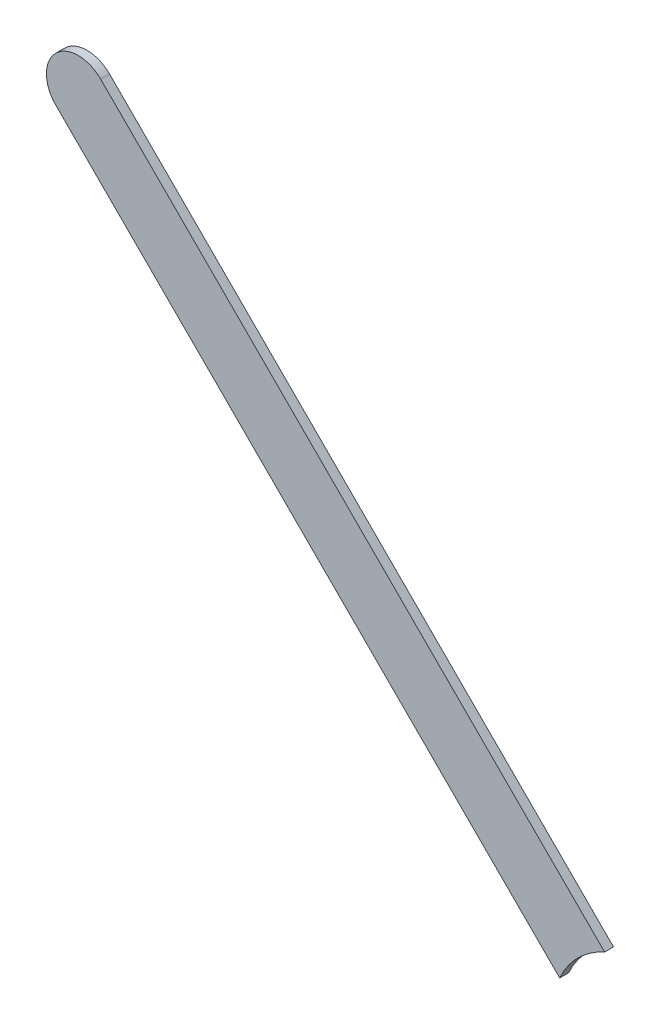
ISO-10303-21;
HEADER;
FILE_DESCRIPTION(('STEP AP214'),'2;1');
FILE_NAME('part.step','',(''),(''),'','','');
FILE_SCHEMA(('AUTOMOTIVE_DESIGN { 1 0 10303 214 1 1 1 1 }'));
ENDSEC;
DATA;
#1=APPLICATION_CONTEXT('core data for automotive mechanical design processes');
#2=APPLICATION_PROTOCOL_DEFINITION('international standard','automotive_design',2000,#1);
#3=PRODUCT_CONTEXT('',#1,'mechanical');
#4=PRODUCT('Part','Part','',(#3));
#5=PRODUCT_RELATED_PRODUCT_CATEGORY('part','',(#4));
#6=PRODUCT_DEFINITION_FORMATION('','',#4);
#7=PRODUCT_DEFINITION_CONTEXT('part definition',#1,'design');
#8=PRODUCT_DEFINITION('design','',#6,#7);
#9=PRODUCT_DEFINITION_SHAPE('','',#8);
#10=(LENGTH_UNIT() NAMED_UNIT(*) SI_UNIT(.MILLI.,.METRE.));
#11=(NAMED_UNIT(*) PLANE_ANGLE_UNIT() SI_UNIT($,.RADIAN.));
#12=(NAMED_UNIT(*) SI_UNIT($,.STERADIAN.) SOLID_ANGLE_UNIT());
#13=UNCERTAINTY_MEASURE_WITH_UNIT(LENGTH_MEASURE(1.E-05),#10,'distance_accuracy_value','');
#14=(GEOMETRIC_REPRESENTATION_CONTEXT(3) GLOBAL_UNCERTAINTY_ASSIGNED_CONTEXT((#13)) GLOBAL_UNIT_ASSIGNED_CONTEXT((#10,
#11,#12)) REPRESENTATION_CONTEXT('',''));
#15=CARTESIAN_POINT('',(0.,0.,0.));
#16=DIRECTION('',(0.,0.,1.));
#17=DIRECTION('',(1.,0.,0.));
#18=AXIS2_PLACEMENT_3D('',#15,#16,#17);
#19=CARTESIAN_POINT('',(93.72717094,84.89726226,0.));
#20=DIRECTION('',(0.70710678118655,0.707106781186545,0.));
#21=DIRECTION('',(0.707106781186545,-0.70710678118655,0.));
#22=AXIS2_PLACEMENT_3D('',#19,#20,#21);
#23=PLANE('',#22);
#24=DIRECTION('',(0.707106781186545,-0.70710678118655,0.));
#25=VECTOR('',#24,1.);
#26=CARTESIAN_POINT('',(93.72717094,84.89726226,0.03556));
#27=LINE('',#26,#25);
#28=CARTESIAN_POINT('',(93.72717094,84.89726226,0.03556));
#29=VERTEX_POINT('',#28);
#30=CARTESIAN_POINT('',(95.7423527371965,82.8820804628035,0.03556));
#31=VERTEX_POINT('',#30);
#32=EDGE_CURVE('E11',#29,#31,#27,.T.);
#33=ORIENTED_EDGE('',*,*,#32,.F.);
#34=DIRECTION('',(0.,0.,1.));
#35=VECTOR('',#34,1.);
#36=CARTESIAN_POINT('',(93.72717094,84.89726226,0.));
#37=LINE('',#36,#35);
#38=CARTESIAN_POINT('',(93.72717094,84.89726226,0.));
#39=VERTEX_POINT('',#38);
#40=EDGE_CURVE('E24',#39,#29,#37,.T.);
#41=ORIENTED_EDGE('',*,*,#40,.F.);
#42=DIRECTION('',(0.707106781186545,-0.70710678118655,0.));
#43=VECTOR('',#42,1.);
#44=CARTESIAN_POINT('',(93.72717094,84.89726226,0.));
#45=LINE('',#44,#43);
#46=CARTESIAN_POINT('',(95.7423527371965,82.8820804628035,0.));
#47=VERTEX_POINT('',#46);
#48=EDGE_CURVE('E75',#39,#47,#45,.T.);
#49=ORIENTED_EDGE('',*,*,#48,.T.);
#50=DIRECTION('',(0.,0.,1.));
#51=VECTOR('',#50,1.);
#52=CARTESIAN_POINT('',(95.7423527371965,82.8820804628035,0.));
#53=LINE('',#52,#51);
#54=EDGE_CURVE('E37',#47,#31,#53,.T.);
#55=ORIENTED_EDGE('',*,*,#54,.T.);
#56=EDGE_LOOP('',(#33,#41,#49,#55));
#57=FACE_BOUND('',#56,.T.);
#58=ADVANCED_FACE('F17',(#57),#23,.F.);
#59=CARTESIAN_POINT('',(96.06701894,82.73701766,0.));
#60=DIRECTION('',(0.,0.,-1.));
#61=DIRECTION('',(1.,0.,0.));
#62=AXIS2_PLACEMENT_3D('',#59,#60,#61);
#63=CYLINDRICAL_SURFACE('',#62,0.3556);
#64=DIRECTION('',(0.,0.,1.));
#65=VECTOR('',#64,1.);
#66=CARTESIAN_POINT('',(95.9219596483949,83.0616854316051,0.));
#67=LINE('',#66,#65);
#68=CARTESIAN_POINT('',(95.9219596483949,83.0616854316051,0.));
#69=VERTEX_POINT('',#68);
#70=CARTESIAN_POINT('',(95.9219596483949,83.0616854316051,0.03556));
#71=VERTEX_POINT('',#70);
#72=EDGE_CURVE('E67',#69,#71,#67,.T.);
#73=ORIENTED_EDGE('',*,*,#72,.T.);
#74=CARTESIAN_POINT('',(96.06701894,82.73701766,0.03556));
#75=DIRECTION('',(0.,0.,1.));
#76=DIRECTION('',(1.,0.,0.));
#77=AXIS2_PLACEMENT_3D('',#74,#75,#76);
#78=CIRCLE('',#77,0.3556);
#79=EDGE_CURVE('E82',#71,#31,#78,.T.);
#80=ORIENTED_EDGE('',*,*,#79,.T.);
#81=ORIENTED_EDGE('',*,*,#54,.F.);
#82=CARTESIAN_POINT('',(96.06701894,82.73701766,0.));
#83=DIRECTION('',(0.,0.,1.));
#84=DIRECTION('',(1.,0.,0.));
#85=AXIS2_PLACEMENT_3D('',#82,#83,#84);
#86=CIRCLE('',#85,0.3556);
#87=EDGE_CURVE('E80',#69,#47,#86,.T.);
#88=ORIENTED_EDGE('',*,*,#87,.F.);
#89=EDGE_LOOP('',(#73,#80,#81,#88));
#90=FACE_BOUND('',#89,.T.);
#91=ADVANCED_FACE('F88',(#90),#63,.F.);
#92=CARTESIAN_POINT('',(95.9219596483949,83.0616854316051,0.));
#93=DIRECTION('',(-0.707106781186548,-0.707106781186548,0.));
#94=DIRECTION('',(-0.707106781186548,0.707106781186548,0.));
#95=AXIS2_PLACEMENT_3D('',#92,#93,#94);
#96=PLANE('',#95);
#97=DIRECTION('',(-0.707106781186548,0.707106781186548,0.));
#98=VECTOR('',#97,1.);
#99=CARTESIAN_POINT('',(96.15682318,82.8268219,0.03556));
#100=LINE('',#99,#98);
#101=CARTESIAN_POINT('',(93.90677688,85.0768682,0.03556));
#102=VERTEX_POINT('',#101);
#103=EDGE_CURVE('E71',#71,#102,#100,.T.);
#104=ORIENTED_EDGE('',*,*,#103,.F.);
#105=ORIENTED_EDGE('',*,*,#72,.F.);
#106=DIRECTION('',(-0.707106781186548,0.707106781186548,0.));
#107=VECTOR('',#106,1.);
#108=CARTESIAN_POINT('',(96.15682318,82.8268219,0.));
#109=LINE('',#108,#107);
#110=CARTESIAN_POINT('',(93.90677688,85.0768682,0.));
#111=VERTEX_POINT('',#110);
#112=EDGE_CURVE('E63',#69,#111,#109,.T.);
#113=ORIENTED_EDGE('',*,*,#112,.T.);
#114=DIRECTION('',(0.,0.,1.));
#115=VECTOR('',#114,1.);
#116=CARTESIAN_POINT('',(93.90677688,85.0768682,0.));
#117=LINE('',#116,#115);
#118=EDGE_CURVE('E53',#111,#102,#117,.T.);
#119=ORIENTED_EDGE('',*,*,#118,.T.);
#120=EDGE_LOOP('',(#104,#105,#113,#119));
#121=FACE_BOUND('',#120,.T.);
#122=ADVANCED_FACE('F66',(#121),#96,.F.);
#123=CARTESIAN_POINT('',(93.81697391,84.98706523,0.));
#124=DIRECTION('',(0.,0.,-1.));
#125=DIRECTION('',(0.707106781186548,0.707106781186548,0.));
#126=AXIS2_PLACEMENT_3D('',#123,#124,#125);
#127=CYLINDRICAL_SURFACE('',#126,0.127000578115382);
#128=CARTESIAN_POINT('',(93.81697391,84.98706523,0.03556));
#129=DIRECTION('',(0.,0.,1.));
#130=DIRECTION('',(0.707106781186548,0.707106781186548,0.));
#131=AXIS2_PLACEMENT_3D('',#128,#129,#130);
#132=CIRCLE('',#131,0.127000578115382);
#133=EDGE_CURVE('E59',#102,#29,#132,.T.);
#134=ORIENTED_EDGE('',*,*,#133,.F.);
#135=ORIENTED_EDGE('',*,*,#118,.F.);
#136=CARTESIAN_POINT('',(93.81697391,84.98706523,0.));
#137=DIRECTION('',(0.,0.,1.));
#138=DIRECTION('',(0.707106781186548,0.707106781186548,0.));
#139=AXIS2_PLACEMENT_3D('',#136,#137,#138);
#140=CIRCLE('',#139,0.127000578115382);
#141=EDGE_CURVE('E57',#111,#39,#140,.T.);
#142=ORIENTED_EDGE('',*,*,#141,.T.);
#143=ORIENTED_EDGE('',*,*,#40,.T.);
#144=EDGE_LOOP('',(#134,#135,#142,#143));
#145=FACE_BOUND('',#144,.T.);
#146=ADVANCED_FACE('F55',(#145),#127,.T.);
#147=CARTESIAN_POINT('',(93.72717094,84.89726226,0.));
#148=DIRECTION('',(0.,0.,-1.));
#149=DIRECTION('',(-1.,0.,0.));
#150=AXIS2_PLACEMENT_3D('',#147,#148,#149);
#151=PLANE('',#150);
#152=ORIENTED_EDGE('',*,*,#48,.F.);
#153=ORIENTED_EDGE('',*,*,#141,.F.);
#154=ORIENTED_EDGE('',*,*,#112,.F.);
#155=ORIENTED_EDGE('',*,*,#87,.T.);
#156=EDGE_LOOP('',(#152,#153,#154,#155));
#157=FACE_BOUND('',#156,.T.);
#158=ADVANCED_FACE('F74',(#157),#151,.T.);
#159=CARTESIAN_POINT('',(93.72717094,84.89726226,0.03556));
#160=DIRECTION('',(0.,0.,-1.));
#161=DIRECTION('',(-1.,0.,0.));
#162=AXIS2_PLACEMENT_3D('',#159,#160,#161);
#163=PLANE('',#162);
#164=ORIENTED_EDGE('',*,*,#133,.T.);
#165=ORIENTED_EDGE('',*,*,#32,.T.);
#166=ORIENTED_EDGE('',*,*,#79,.F.);
#167=ORIENTED_EDGE('',*,*,#103,.T.);
#168=EDGE_LOOP('',(#164,#165,#166,#167));
#169=FACE_BOUND('',#168,.T.);
#170=ADVANCED_FACE('F91',(#169),#163,.F.);
#171=CLOSED_SHELL('',(#58,#91,#122,#146,#158,#170));
#172=MANIFOLD_SOLID_BREP('B1',#171);
#173=ADVANCED_BREP_SHAPE_REPRESENTATION('',(#18,#172),#14);
#174=SHAPE_DEFINITION_REPRESENTATION(#9,#173);
ENDSEC;
END-ISO-10303-21;
